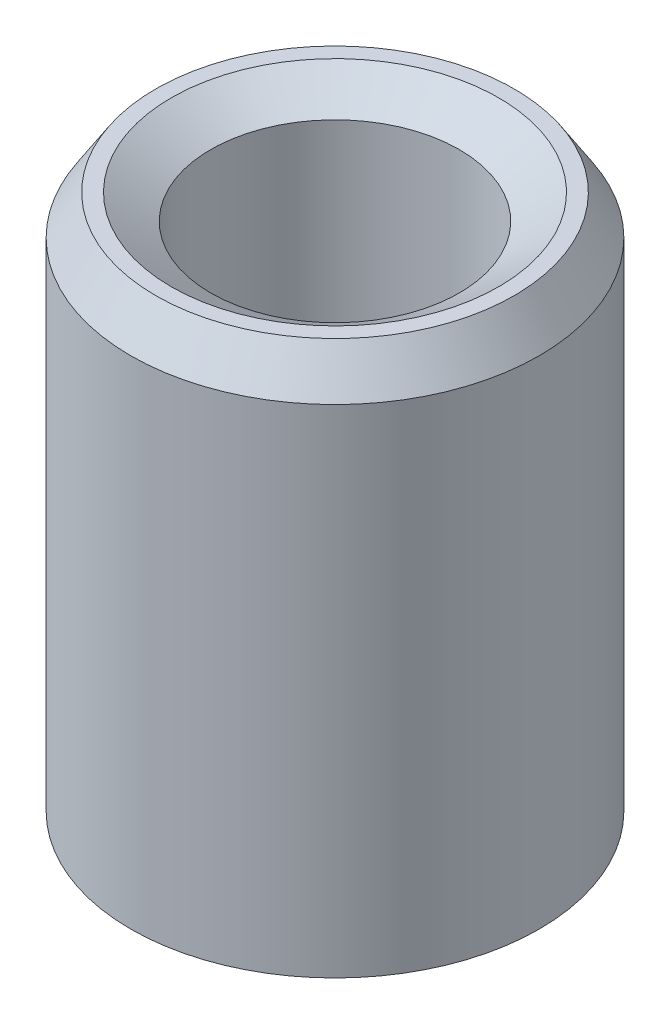
ISO-10303-21;
HEADER;
FILE_DESCRIPTION(('STEP AP214'),'2;1');
FILE_NAME('part.step','',(''),(''),'','','');
FILE_SCHEMA(('AUTOMOTIVE_DESIGN { 1 0 10303 214 1 1 1 1 }'));
ENDSEC;
DATA;
#1=APPLICATION_CONTEXT('core data for automotive mechanical design processes');
#2=APPLICATION_PROTOCOL_DEFINITION('international standard','automotive_design',2000,#1);
#3=PRODUCT_CONTEXT('',#1,'mechanical');
#4=PRODUCT('Part','Part','',(#3));
#5=PRODUCT_RELATED_PRODUCT_CATEGORY('part','',(#4));
#6=PRODUCT_DEFINITION_FORMATION('','',#4);
#7=PRODUCT_DEFINITION_CONTEXT('part definition',#1,'design');
#8=PRODUCT_DEFINITION('design','',#6,#7);
#9=PRODUCT_DEFINITION_SHAPE('','',#8);
#10=(LENGTH_UNIT() NAMED_UNIT(*) SI_UNIT(.MILLI.,.METRE.));
#11=(NAMED_UNIT(*) PLANE_ANGLE_UNIT() SI_UNIT($,.RADIAN.));
#12=(NAMED_UNIT(*) SI_UNIT($,.STERADIAN.) SOLID_ANGLE_UNIT());
#13=UNCERTAINTY_MEASURE_WITH_UNIT(LENGTH_MEASURE(1.E-05),#10,'distance_accuracy_value','');
#14=(GEOMETRIC_REPRESENTATION_CONTEXT(3) GLOBAL_UNCERTAINTY_ASSIGNED_CONTEXT((#13)) GLOBAL_UNIT_ASSIGNED_CONTEXT((#10,
#11,#12)) REPRESENTATION_CONTEXT('',''));
#15=CARTESIAN_POINT('',(0.,0.,0.));
#16=DIRECTION('',(0.,0.,1.));
#17=DIRECTION('',(1.,0.,0.));
#18=AXIS2_PLACEMENT_3D('',#15,#16,#17);
#19=CARTESIAN_POINT('',(0.,20.6025206112268,0.));
#20=DIRECTION('',(0.,-1.,0.));
#21=DIRECTION('',(0.,0.,-1.));
#22=AXIS2_PLACEMENT_3D('',#19,#20,#21);
#23=CYLINDRICAL_SURFACE('',#22,7.5);
#24=CARTESIAN_POINT('',(0.,0.921982273435745,0.));
#25=DIRECTION('',(0.,1.,0.));
#26=DIRECTION('',(0.,0.,1.));
#27=AXIS2_PLACEMENT_3D('',#24,#25,#26);
#28=CIRCLE('',#27,7.5);
#29=CARTESIAN_POINT('',(0.,0.921982273435744,7.5));
#30=VERTEX_POINT('',#29);
#31=EDGE_CURVE('E10',#30,#30,#28,.T.);
#32=ORIENTED_EDGE('',*,*,#31,.T.);
#33=EDGE_LOOP('',(#32));
#34=FACE_BOUND('',#33,.T.);
#35=CARTESIAN_POINT('',(0.,19.1548693949765,0.));
#36=DIRECTION('',(0.,1.,0.));
#37=DIRECTION('',(0.,0.,1.));
#38=AXIS2_PLACEMENT_3D('',#35,#36,#37);
#39=CIRCLE('',#38,7.5);
#40=CARTESIAN_POINT('',(0.,19.1548693949765,7.5));
#41=VERTEX_POINT('',#40);
#42=EDGE_CURVE('E50',#41,#41,#39,.F.);
#43=ORIENTED_EDGE('',*,*,#42,.T.);
#44=EDGE_LOOP('',(#43));
#45=FACE_BOUND('',#44,.T.);
#46=ADVANCED_FACE('F39',(#34,#45),#23,.T.);
#47=CARTESIAN_POINT('',(0.,20.6025206112268,0.));
#48=DIRECTION('',(0.,1.,0.));
#49=DIRECTION('',(0.,0.,1.));
#50=AXIS2_PLACEMENT_3D('',#47,#48,#49);
#51=PLANE('',#50);
#52=CARTESIAN_POINT('',(0.,20.6025206112268,0.));
#53=DIRECTION('',(0.,1.,0.));
#54=DIRECTION('',(0.,0.,1.));
#55=AXIS2_PLACEMENT_3D('',#52,#53,#54);
#56=CIRCLE('',#55,6.01086574607561);
#57=CARTESIAN_POINT('',(0.,20.6025206112268,6.01086574607561));
#58=VERTEX_POINT('',#57);
#59=EDGE_CURVE('E58',#58,#58,#56,.F.);
#60=ORIENTED_EDGE('',*,*,#59,.T.);
#61=EDGE_LOOP('',(#60));
#62=FACE_BOUND('',#61,.T.);
#63=CARTESIAN_POINT('',(0.,20.6025206112268,0.));
#64=DIRECTION('',(0.,1.,0.));
#65=DIRECTION('',(0.,0.,1.));
#66=AXIS2_PLACEMENT_3D('',#63,#64,#65);
#67=CIRCLE('',#66,6.57801772656426);
#68=CARTESIAN_POINT('',(0.,20.6025206112268,6.57801772656426));
#69=VERTEX_POINT('',#68);
#70=EDGE_CURVE('E61',#69,#69,#67,.T.);
#71=ORIENTED_EDGE('',*,*,#70,.T.);
#72=EDGE_LOOP('',(#71));
#73=FACE_BOUND('',#72,.T.);
#74=ADVANCED_FACE('F88',(#62,#73),#51,.T.);
#75=CARTESIAN_POINT('',(0.,0.,0.));
#76=DIRECTION('',(0.,1.,0.));
#77=DIRECTION('',(0.,0.,1.));
#78=AXIS2_PLACEMENT_3D('',#75,#76,#77);
#79=PLANE('',#78);
#80=CARTESIAN_POINT('',(0.,0.,0.));
#81=DIRECTION('',(0.,1.,0.));
#82=DIRECTION('',(0.,0.,1.));
#83=AXIS2_PLACEMENT_3D('',#80,#81,#82);
#84=CIRCLE('',#83,5.48519680326105);
#85=CARTESIAN_POINT('',(0.,0.,5.48519680326105));
#86=VERTEX_POINT('',#85);
#87=EDGE_CURVE('E51',#86,#86,#84,.T.);
#88=ORIENTED_EDGE('',*,*,#87,.T.);
#89=EDGE_LOOP('',(#88));
#90=FACE_BOUND('',#89,.T.);
#91=CARTESIAN_POINT('',(0.,0.,0.));
#92=DIRECTION('',(0.,1.,0.));
#93=DIRECTION('',(0.,0.,1.));
#94=AXIS2_PLACEMENT_3D('',#91,#92,#93);
#95=CIRCLE('',#94,6.05234878374968);
#96=CARTESIAN_POINT('',(0.,0.,6.05234878374968));
#97=VERTEX_POINT('',#96);
#98=EDGE_CURVE('E54',#97,#97,#95,.F.);
#99=ORIENTED_EDGE('',*,*,#98,.T.);
#100=EDGE_LOOP('',(#99));
#101=FACE_BOUND('',#100,.T.);
#102=ADVANCED_FACE('F83',(#90,#101),#79,.F.);
#103=CARTESIAN_POINT('',(0.,20.6025206112268,0.));
#104=DIRECTION('',(0.,-1.,0.));
#105=DIRECTION('',(0.,0.,-1.));
#106=AXIS2_PLACEMENT_3D('',#103,#104,#105);
#107=CYLINDRICAL_SURFACE('',#106,4.5632145298253);
#108=CARTESIAN_POINT('',(0.,19.6805383377911,0.));
#109=DIRECTION('',(0.,1.,0.));
#110=DIRECTION('',(0.,0.,1.));
#111=AXIS2_PLACEMENT_3D('',#108,#109,#110);
#112=CIRCLE('',#111,4.5632145298253);
#113=CARTESIAN_POINT('',(0.,19.6805383377911,4.5632145298253));
#114=VERTEX_POINT('',#113);
#115=EDGE_CURVE('E67',#114,#114,#112,.T.);
#116=ORIENTED_EDGE('',*,*,#115,.T.);
#117=EDGE_LOOP('',(#116));
#118=FACE_BOUND('',#117,.T.);
#119=CARTESIAN_POINT('',(0.,1.44765121625032,0.));
#120=DIRECTION('',(0.,1.,0.));
#121=DIRECTION('',(0.,0.,1.));
#122=AXIS2_PLACEMENT_3D('',#119,#120,#121);
#123=CIRCLE('',#122,4.5632145298253);
#124=CARTESIAN_POINT('',(0.,1.44765121625032,4.5632145298253));
#125=VERTEX_POINT('',#124);
#126=EDGE_CURVE('E69',#125,#125,#123,.F.);
#127=ORIENTED_EDGE('',*,*,#126,.T.);
#128=EDGE_LOOP('',(#127));
#129=FACE_BOUND('',#128,.T.);
#130=ADVANCED_FACE('F71',(#118,#129),#107,.F.);
#131=CARTESIAN_POINT('',(0.,19.6805383377911,0.));
#132=DIRECTION('',(0.,1.,0.));
#133=DIRECTION('',(0.,0.,1.));
#134=AXIS2_PLACEMENT_3D('',#131,#132,#133);
#135=CONICAL_SURFACE('',#134,4.5632145298253,1.00369860095125);
#136=CARTESIAN_POINT('',(0.,20.6025206112268,6.01086574607561));
#137=CARTESIAN_POINT('',(0.,20.5929166292119,5.99578604590633));
#138=CARTESIAN_POINT('',(0.,20.5833126471969,5.98070634573706));
#139=CARTESIAN_POINT('',(0.,20.564104683167,5.95054694539851));
#140=CARTESIAN_POINT('',(0.,20.5545007011521,5.93546724522924));
#141=CARTESIAN_POINT('',(0.,20.5352927371222,5.90530784489069));
#142=CARTESIAN_POINT('',(0.,20.5256887551072,5.89022814472142));
#143=CARTESIAN_POINT('',(0.,20.5064807910773,5.86006874438287));
#144=CARTESIAN_POINT('',(0.,20.4968768090623,5.84498904421359));
#145=CARTESIAN_POINT('',(0.,20.4776688450324,5.81482964387505));
#146=CARTESIAN_POINT('',(0.,20.4680648630175,5.79974994370577));
#147=CARTESIAN_POINT('',(0.,20.4488568989876,5.76959054336722));
#148=CARTESIAN_POINT('',(0.,20.4392529169726,5.75451084319795));
#149=CARTESIAN_POINT('',(0.,20.4200449529427,5.7243514428594));
#150=CARTESIAN_POINT('',(0.,20.4104409709277,5.70927174269013));
#151=CARTESIAN_POINT('',(0.,20.3912330068978,5.67911234235158));
#152=CARTESIAN_POINT('',(0.,20.3816290248829,5.66403264218231));
#153=CARTESIAN_POINT('',(0.,20.3624210608529,5.63387324184376));
#154=CARTESIAN_POINT('',(0.,20.352817078838,5.61879354167448));
#155=CARTESIAN_POINT('',(0.,20.3336091148081,5.58863414133594));
#156=CARTESIAN_POINT('',(0.,20.3240051327931,5.57355444116666));
#157=CARTESIAN_POINT('',(0.,20.3047971687632,5.54339504082811));
#158=CARTESIAN_POINT('',(0.,20.2951931867483,5.52831534065884));
#159=CARTESIAN_POINT('',(0.,20.2759852227183,5.49815594032029));
#160=CARTESIAN_POINT('',(0.,20.2663812407034,5.48307624015102));
#161=CARTESIAN_POINT('',(0.,20.2471732766735,5.45291683981247));
#162=CARTESIAN_POINT('',(0.,20.2375692946585,5.43783713964319));
#163=CARTESIAN_POINT('',(0.,20.2183613306286,5.40767773930465));
#164=CARTESIAN_POINT('',(0.,20.2087573486137,5.39259803913537));
#165=CARTESIAN_POINT('',(0.,20.1895493845837,5.36243863879682));
#166=CARTESIAN_POINT('',(0.,20.1799454025688,5.34735893862755));
#167=CARTESIAN_POINT('',(0.,20.1607374385389,5.317199538289));
#168=CARTESIAN_POINT('',(0.,20.1511334565239,5.30211983811973));
#169=CARTESIAN_POINT('',(0.,20.131925492494,5.27196043778118));
#170=CARTESIAN_POINT('',(0.,20.1223215104791,5.2568807376119));
#171=CARTESIAN_POINT('',(0.,20.1031135464491,5.22672133727336));
#172=CARTESIAN_POINT('',(0.,20.0935095644342,5.21164163710408));
#173=CARTESIAN_POINT('',(0.,20.0743016004043,5.18148223676553));
#174=CARTESIAN_POINT('',(0.,20.0646976183893,5.16640253659626));
#175=CARTESIAN_POINT('',(0.,20.0454896543594,5.13624313625771));
#176=CARTESIAN_POINT('',(0.,20.0358856723445,5.12116343608844));
#177=CARTESIAN_POINT('',(0.,20.0166777083145,5.09100403574989));
#178=CARTESIAN_POINT('',(0.,20.0070737262996,5.07592433558062));
#179=CARTESIAN_POINT('',(0.,19.9878657622697,5.04576493524207));
#180=CARTESIAN_POINT('',(0.,19.9782617802547,5.03068523507279));
#181=CARTESIAN_POINT('',(0.,19.9590538162248,5.00052583473425));
#182=CARTESIAN_POINT('',(0.,19.9494498342099,4.98544613456497));
#183=CARTESIAN_POINT('',(0.,19.9302418701799,4.95528673422642));
#184=CARTESIAN_POINT('',(0.,19.920637888165,4.94020703405715));
#185=CARTESIAN_POINT('',(0.,19.9014299241351,4.9100476337186));
#186=CARTESIAN_POINT('',(0.,19.8918259421201,4.89496793354933));
#187=CARTESIAN_POINT('',(0.,19.8726179780902,4.86480853321078));
#188=CARTESIAN_POINT('',(0.,19.8630139960753,4.8497288330415));
#189=CARTESIAN_POINT('',(0.,19.8438060320453,4.81956943270296));
#190=CARTESIAN_POINT('',(0.,19.8342020500304,4.80448973253368));
#191=CARTESIAN_POINT('',(0.,19.8149940860005,4.77433033219513));
#192=CARTESIAN_POINT('',(0.,19.8053901039855,4.75925063202586));
#193=CARTESIAN_POINT('',(0.,19.7861821399556,4.72909123168731));
#194=CARTESIAN_POINT('',(0.,19.7765781579407,4.71401153151804));
#195=CARTESIAN_POINT('',(0.,19.7573701939107,4.68385213117949));
#196=CARTESIAN_POINT('',(0.,19.7477662118958,4.66877243101022));
#197=CARTESIAN_POINT('',(0.,19.7285582478659,4.63861303067167));
#198=CARTESIAN_POINT('',(0.,19.7189542658509,4.62353333050239));
#199=CARTESIAN_POINT('',(0.,19.699746301821,4.59337393016385));
#200=CARTESIAN_POINT('',(0.,19.690142319806,4.57829422999457));
#201=CARTESIAN_POINT('',(0.,19.6805383377911,4.5632145298253));
#202=B_SPLINE_CURVE_WITH_KNOTS('',3,(#136,#137,#138,#139,#140,#141,#142,#143,#144,#145,#146,
#147,#148,#149,#150,#151,#152,#153,#154,#155,#156,#157,#158,#159,#160,#161,#162,#163,#164,#165,
#166,#167,#168,#169,#170,#171,#172,#173,#174,#175,#176,#177,#178,#179,#180,#181,#182,#183,#184,
#185,#186,#187,#188,#189,#190,#191,#192,#193,#194,#195,#196,#197,#198,#199,#200,#201),
.UNSPECIFIED.,.F.,.F.,(4,2,2,2,2,2,2,2,2,2,2,2,2,2,2,2,2,2,2,2,2,2,2,2,2,2,2,2,2,2,2,2,4),(0.,
0.0536349181937403,0.10726983638748,0.16090475458122,0.214539672774961,0.268174590968701,
0.321809509162441,0.375444427356179,0.429079345549919,0.48271426374366,0.536349181937399,
0.58998410013114,0.64361901832488,0.697253936518618,0.750888854712359,0.804523772906099,
0.858158691099839,0.911793609293579,0.965428527487319,1.01906344568106,1.0726983638748,
1.12633328206854,1.17996820026228,1.23360311845602,1.28723803664976,1.3408729548435,
1.39450787303724,1.44814279123098,1.50177770942472,1.55541262761846,1.6090475458122,
1.66268246400594,1.71631738219968),.UNSPECIFIED.);
#203=EDGE_CURVE('BSEAM77',#58,#114,#202,.T.);
#204=ORIENTED_EDGE('',*,*,#59,.F.);
#205=ORIENTED_EDGE('',*,*,#115,.F.);
#206=ORIENTED_EDGE('',*,*,#203,.T.);
#207=ORIENTED_EDGE('',*,*,#203,.F.);
#208=EDGE_LOOP('',(#204,#206,#205,#207));
#209=FACE_BOUND('',#208,.T.);
#210=ADVANCED_FACE('F77',(#209),#135,.F.);
#211=CARTESIAN_POINT('',(0.,0.,0.));
#212=DIRECTION('',(0.,-1.,0.));
#213=DIRECTION('',(0.,0.,-1.));
#214=AXIS2_PLACEMENT_3D('',#211,#212,#213);
#215=CONICAL_SURFACE('',#214,5.48519680326105,0.567097725843641);
#216=ORIENTED_EDGE('',*,*,#126,.F.);
#217=EDGE_LOOP('',(#216));
#218=FACE_BOUND('',#217,.T.);
#219=ORIENTED_EDGE('',*,*,#87,.F.);
#220=EDGE_LOOP('',(#219));
#221=FACE_BOUND('',#220,.T.);
#222=ADVANCED_FACE('F73',(#218,#221),#215,.F.);
#223=CARTESIAN_POINT('',(0.,0.921982273435745,0.));
#224=DIRECTION('',(0.,1.,0.));
#225=DIRECTION('',(0.,0.,1.));
#226=AXIS2_PLACEMENT_3D('',#223,#224,#225);
#227=CONICAL_SURFACE('',#226,7.5,1.00369860095126);
#228=CARTESIAN_POINT('',(0.,0.,6.05234878374968));
#229=CARTESIAN_POINT('',(0.,0.00960398201495601,6.06742848391896));
#230=CARTESIAN_POINT('',(0.,0.0192079640299115,6.08250818408823));
#231=CARTESIAN_POINT('',(0.,0.0384159280598226,6.11266758442678));
#232=CARTESIAN_POINT('',(0.,0.0480199100747781,6.12774728459605));
#233=CARTESIAN_POINT('',(0.,0.0672278741046895,6.1579066849346));
#234=CARTESIAN_POINT('',(0.,0.0768318561196454,6.17298638510387));
#235=CARTESIAN_POINT('',(0.,0.0960398201495567,6.20314578544242));
#236=CARTESIAN_POINT('',(0.,0.105643802164512,6.2182254856117));
#237=CARTESIAN_POINT('',(0.,0.124851766194424,6.24838488595025));
#238=CARTESIAN_POINT('',(0.,0.134455748209379,6.26346458611952));
#239=CARTESIAN_POINT('',(0.,0.153663712239291,6.29362398645807));
#240=CARTESIAN_POINT('',(0.,0.163267694254246,6.30870368662734));
#241=CARTESIAN_POINT('',(0.,0.182475658284158,6.33886308696589));
#242=CARTESIAN_POINT('',(0.,0.192079640299113,6.35394278713517));
#243=CARTESIAN_POINT('',(0.,0.211287604329025,6.38410218747371));
#244=CARTESIAN_POINT('',(0.,0.22089158634398,6.39918188764299));
#245=CARTESIAN_POINT('',(0.,0.240099550373892,6.42934128798154));
#246=CARTESIAN_POINT('',(0.,0.249703532388847,6.44442098815081));
#247=CARTESIAN_POINT('',(0.,0.268911496418759,6.47458038848936));
#248=CARTESIAN_POINT('',(0.,0.278515478433714,6.48966008865863));
#249=CARTESIAN_POINT('',(0.,0.297723442463626,6.51981948899718));
#250=CARTESIAN_POINT('',(0.,0.307327424478582,6.53489918916645));
#251=CARTESIAN_POINT('',(0.,0.326535388508493,6.565058589505));
#252=CARTESIAN_POINT('',(0.,0.336139370523448,6.58013828967428));
#253=CARTESIAN_POINT('',(0.,0.35534733455336,6.61029769001283));
#254=CARTESIAN_POINT('',(0.,0.364951316568316,6.6253773901821));
#255=CARTESIAN_POINT('',(0.,0.384159280598227,6.65553679052065));
#256=CARTESIAN_POINT('',(0.,0.393763262613183,6.67061649068992));
#257=CARTESIAN_POINT('',(0.,0.412971226643094,6.70077589102847));
#258=CARTESIAN_POINT('',(0.,0.42257520865805,6.71585559119774));
#259=CARTESIAN_POINT('',(0.,0.441783172687961,6.74601499153629));
#260=CARTESIAN_POINT('',(0.,0.451387154702917,6.76109469170557));
#261=CARTESIAN_POINT('',(0.,0.470595118732828,6.79125409204412));
#262=CARTESIAN_POINT('',(0.,0.480199100747783,6.80633379221339));
#263=CARTESIAN_POINT('',(0.,0.499407064777695,6.83649319255194));
#264=CARTESIAN_POINT('',(0.,0.509011046792651,6.85157289272121));
#265=CARTESIAN_POINT('',(0.,0.528219010822562,6.88173229305976));
#266=CARTESIAN_POINT('',(0.,0.537822992837518,6.89681199322903));
#267=CARTESIAN_POINT('',(0.,0.557030956867429,6.92697139356758));
#268=CARTESIAN_POINT('',(0.,0.566634938882385,6.94205109373686));
#269=CARTESIAN_POINT('',(0.,0.585842902912296,6.97221049407541));
#270=CARTESIAN_POINT('',(0.,0.595446884927252,6.98729019424468));
#271=CARTESIAN_POINT('',(0.,0.614654848957163,7.01744959458323));
#272=CARTESIAN_POINT('',(0.,0.624258830972119,7.0325292947525));
#273=CARTESIAN_POINT('',(0.,0.64346679500203,7.06268869509105));
#274=CARTESIAN_POINT('',(0.,0.653070777016986,7.07776839526032));
#275=CARTESIAN_POINT('',(0.,0.672278741046897,7.10792779559887));
#276=CARTESIAN_POINT('',(0.,0.681882723061853,7.12300749576815));
#277=CARTESIAN_POINT('',(0.,0.701090687091764,7.1531668961067));
#278=CARTESIAN_POINT('',(0.,0.71069466910672,7.16824659627597));
#279=CARTESIAN_POINT('',(0.,0.729902633136631,7.19840599661452));
#280=CARTESIAN_POINT('',(0.,0.739506615151587,7.21348569678379));
#281=CARTESIAN_POINT('',(0.,0.758714579181498,7.24364509712234));
#282=CARTESIAN_POINT('',(0.,0.768318561196454,7.25872479729161));
#283=CARTESIAN_POINT('',(0.,0.787526525226365,7.28888419763016));
#284=CARTESIAN_POINT('',(0.,0.797130507241321,7.30396389779944));
#285=CARTESIAN_POINT('',(0.,0.816338471271232,7.33412329813798));
#286=CARTESIAN_POINT('',(0.,0.825942453286188,7.34920299830726));
#287=CARTESIAN_POINT('',(0.,0.845150417316099,7.37936239864581));
#288=CARTESIAN_POINT('',(0.,0.854754399331055,7.39444209881508));
#289=CARTESIAN_POINT('',(0.,0.873962363360966,7.42460149915363));
#290=CARTESIAN_POINT('',(0.,0.883566345375922,7.4396811993229));
#291=CARTESIAN_POINT('',(0.,0.902774309405833,7.46984059966145));
#292=CARTESIAN_POINT('',(0.,0.912378291420789,7.48492029983073));
#293=CARTESIAN_POINT('',(0.,0.921982273435744,7.5));
#294=B_SPLINE_CURVE_WITH_KNOTS('',3,(#228,#229,#230,#231,#232,#233,#234,#235,#236,#237,#238,
#239,#240,#241,#242,#243,#244,#245,#246,#247,#248,#249,#250,#251,#252,#253,#254,#255,#256,#257,
#258,#259,#260,#261,#262,#263,#264,#265,#266,#267,#268,#269,#270,#271,#272,#273,#274,#275,#276,
#277,#278,#279,#280,#281,#282,#283,#284,#285,#286,#287,#288,#289,#290,#291,#292,#293),
.UNSPECIFIED.,.F.,.F.,(4,2,2,2,2,2,2,2,2,2,2,2,2,2,2,2,2,2,2,2,2,2,2,2,2,2,2,2,2,2,2,2,4),(0.,
0.0536349181937393,0.10726983638748,0.160904754581219,0.21453967277496,0.268174590968699,
0.32180950916244,0.37544442735618,0.42907934554992,0.48271426374366,0.5363491819374,
0.58998410013114,0.64361901832488,0.697253936518621,0.750888854712361,0.804523772906101,
0.858158691099841,0.911793609293581,0.965428527487321,1.01906344568106,1.0726983638748,
1.12633328206854,1.17996820026228,1.23360311845602,1.28723803664976,1.3408729548435,
1.39450787303724,1.44814279123098,1.50177770942472,1.55541262761846,1.6090475458122,
1.66268246400594,1.71631738219968),.UNSPECIFIED.);
#295=EDGE_CURVE('BSEAM76',#97,#30,#294,.T.);
#296=ORIENTED_EDGE('',*,*,#98,.F.);
#297=ORIENTED_EDGE('',*,*,#31,.F.);
#298=ORIENTED_EDGE('',*,*,#295,.T.);
#299=ORIENTED_EDGE('',*,*,#295,.F.);
#300=EDGE_LOOP('',(#296,#298,#297,#299));
#301=FACE_BOUND('',#300,.T.);
#302=ADVANCED_FACE('F76',(#301),#227,.T.);
#303=CARTESIAN_POINT('',(0.,20.6025206112268,0.));
#304=DIRECTION('',(0.,-1.,0.));
#305=DIRECTION('',(0.,0.,-1.));
#306=AXIS2_PLACEMENT_3D('',#303,#304,#305);
#307=CONICAL_SURFACE('',#306,6.57801772656426,0.56709772584364);
#308=ORIENTED_EDGE('',*,*,#42,.F.);
#309=EDGE_LOOP('',(#308));
#310=FACE_BOUND('',#309,.T.);
#311=ORIENTED_EDGE('',*,*,#70,.F.);
#312=EDGE_LOOP('',(#311));
#313=FACE_BOUND('',#312,.T.);
#314=ADVANCED_FACE('F45',(#310,#313),#307,.T.);
#315=CLOSED_SHELL('',(#46,#74,#102,#130,#210,#222,#302,#314));
#316=MANIFOLD_SOLID_BREP('B2',#315);
#317=ADVANCED_BREP_SHAPE_REPRESENTATION('',(#18,#316),#14);
#318=SHAPE_DEFINITION_REPRESENTATION(#9,#317);
ENDSEC;
END-ISO-10303-21;
